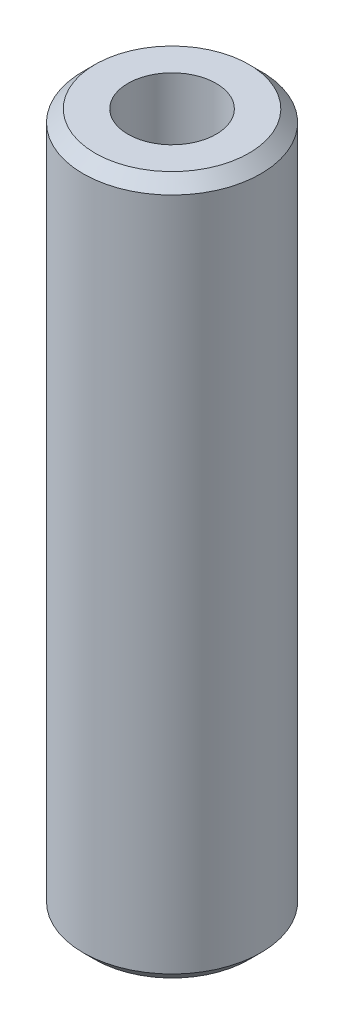
ISO-10303-21;
HEADER;
FILE_DESCRIPTION(('STEP AP214'),'2;1');
FILE_NAME('part.step','',(''),(''),'','','');
FILE_SCHEMA(('AUTOMOTIVE_DESIGN { 1 0 10303 214 1 1 1 1 }'));
ENDSEC;
DATA;
#1=APPLICATION_CONTEXT('core data for automotive mechanical design processes');
#2=APPLICATION_PROTOCOL_DEFINITION('international standard','automotive_design',2000,#1);
#3=PRODUCT_CONTEXT('',#1,'mechanical');
#4=PRODUCT('Part','Part','',(#3));
#5=PRODUCT_RELATED_PRODUCT_CATEGORY('part','',(#4));
#6=PRODUCT_DEFINITION_FORMATION('','',#4);
#7=PRODUCT_DEFINITION_CONTEXT('part definition',#1,'design');
#8=PRODUCT_DEFINITION('design','',#6,#7);
#9=PRODUCT_DEFINITION_SHAPE('','',#8);
#10=(LENGTH_UNIT() NAMED_UNIT(*) SI_UNIT(.MILLI.,.METRE.));
#11=(NAMED_UNIT(*) PLANE_ANGLE_UNIT() SI_UNIT($,.RADIAN.));
#12=(NAMED_UNIT(*) SI_UNIT($,.STERADIAN.) SOLID_ANGLE_UNIT());
#13=UNCERTAINTY_MEASURE_WITH_UNIT(LENGTH_MEASURE(1.E-05),#10,'distance_accuracy_value','');
#14=(GEOMETRIC_REPRESENTATION_CONTEXT(3) GLOBAL_UNCERTAINTY_ASSIGNED_CONTEXT((#13)) GLOBAL_UNIT_ASSIGNED_CONTEXT((#10,
#11,#12)) REPRESENTATION_CONTEXT('',''));
#15=CARTESIAN_POINT('',(0.,0.,0.));
#16=DIRECTION('',(0.,0.,1.));
#17=DIRECTION('',(1.,0.,0.));
#18=AXIS2_PLACEMENT_3D('',#15,#16,#17);
#19=CARTESIAN_POINT('',(0.,78.6237440743389,0.));
#20=DIRECTION('',(0.,-1.,0.));
#21=DIRECTION('',(0.,0.,-1.));
#22=AXIS2_PLACEMENT_3D('',#19,#20,#21);
#23=CYLINDRICAL_SURFACE('',#22,10.);
#24=CARTESIAN_POINT('',(0.,77.2846726138983,0.));
#25=DIRECTION('',(0.,1.,0.));
#26=DIRECTION('',(0.,0.,1.));
#27=AXIS2_PLACEMENT_3D('',#24,#25,#26);
#28=CIRCLE('',#27,10.);
#29=CARTESIAN_POINT('',(0.,77.2846726138983,10.));
#30=VERTEX_POINT('',#29);
#31=EDGE_CURVE('E50',#30,#30,#28,.F.);
#32=ORIENTED_EDGE('',*,*,#31,.T.);
#33=EDGE_LOOP('',(#32));
#34=FACE_BOUND('',#33,.T.);
#35=CARTESIAN_POINT('',(0.,1.3390714604406,0.));
#36=DIRECTION('',(0.,1.,0.));
#37=DIRECTION('',(0.,0.,1.));
#38=AXIS2_PLACEMENT_3D('',#35,#36,#37);
#39=CIRCLE('',#38,10.);
#40=CARTESIAN_POINT('',(0.,1.3390714604406,10.));
#41=VERTEX_POINT('',#40);
#42=EDGE_CURVE('E51',#41,#41,#39,.T.);
#43=ORIENTED_EDGE('',*,*,#42,.T.);
#44=EDGE_LOOP('',(#43));
#45=FACE_BOUND('',#44,.T.);
#46=ADVANCED_FACE('F39',(#34,#45),#23,.T.);
#47=CARTESIAN_POINT('',(0.,78.6237440743389,0.));
#48=DIRECTION('',(0.,1.,0.));
#49=DIRECTION('',(0.,0.,1.));
#50=AXIS2_PLACEMENT_3D('',#47,#48,#49);
#51=PLANE('',#50);
#52=CARTESIAN_POINT('',(0.,78.6237440743389,0.));
#53=DIRECTION('',(0.,1.,0.));
#54=DIRECTION('',(0.,0.,1.));
#55=AXIS2_PLACEMENT_3D('',#52,#53,#54);
#56=CIRCLE('',#55,8.6609285395594);
#57=CARTESIAN_POINT('',(0.,78.6237440743389,8.6609285395594));
#58=VERTEX_POINT('',#57);
#59=EDGE_CURVE('E54',#58,#58,#56,.T.);
#60=ORIENTED_EDGE('',*,*,#59,.T.);
#61=EDGE_LOOP('',(#60));
#62=FACE_BOUND('',#61,.T.);
#63=CARTESIAN_POINT('',(0.,78.6237440743389,0.));
#64=DIRECTION('',(0.,1.,0.));
#65=DIRECTION('',(0.,0.,1.));
#66=AXIS2_PLACEMENT_3D('',#63,#64,#65);
#67=CIRCLE('',#66,4.96523428828797);
#68=CARTESIAN_POINT('',(0.,78.6237440743389,4.96523428828797));
#69=VERTEX_POINT('',#68);
#70=EDGE_CURVE('E58',#69,#69,#67,.T.);
#71=ORIENTED_EDGE('',*,*,#70,.F.);
#72=EDGE_LOOP('',(#71));
#73=FACE_BOUND('',#72,.T.);
#74=ADVANCED_FACE('F69',(#62,#73),#51,.T.);
#75=CARTESIAN_POINT('',(0.,0.,0.));
#76=DIRECTION('',(0.,1.,0.));
#77=DIRECTION('',(0.,0.,1.));
#78=AXIS2_PLACEMENT_3D('',#75,#76,#77);
#79=PLANE('',#78);
#80=CARTESIAN_POINT('',(0.,0.,0.));
#81=DIRECTION('',(0.,1.,0.));
#82=DIRECTION('',(0.,0.,1.));
#83=AXIS2_PLACEMENT_3D('',#80,#81,#82);
#84=CIRCLE('',#83,8.66092853955939);
#85=CARTESIAN_POINT('',(0.,0.,8.66092853955939));
#86=VERTEX_POINT('',#85);
#87=EDGE_CURVE('E10',#86,#86,#84,.F.);
#88=ORIENTED_EDGE('',*,*,#87,.T.);
#89=EDGE_LOOP('',(#88));
#90=FACE_BOUND('',#89,.T.);
#91=CARTESIAN_POINT('',(0.,0.,0.));
#92=DIRECTION('',(0.,1.,0.));
#93=DIRECTION('',(0.,0.,1.));
#94=AXIS2_PLACEMENT_3D('',#91,#92,#93);
#95=CIRCLE('',#94,4.96523428828797);
#96=CARTESIAN_POINT('',(0.,0.,4.96523428828797));
#97=VERTEX_POINT('',#96);
#98=EDGE_CURVE('E63',#97,#97,#95,.T.);
#99=ORIENTED_EDGE('',*,*,#98,.T.);
#100=EDGE_LOOP('',(#99));
#101=FACE_BOUND('',#100,.T.);
#102=ADVANCED_FACE('F75',(#90,#101),#79,.F.);
#103=CARTESIAN_POINT('',(0.,78.6237440743389,0.));
#104=DIRECTION('',(0.,-1.,0.));
#105=DIRECTION('',(0.,0.,-1.));
#106=AXIS2_PLACEMENT_3D('',#103,#104,#105);
#107=CYLINDRICAL_SURFACE('',#106,4.96523428828797);
#108=ORIENTED_EDGE('',*,*,#70,.T.);
#109=EDGE_LOOP('',(#108));
#110=FACE_BOUND('',#109,.T.);
#111=ORIENTED_EDGE('',*,*,#98,.F.);
#112=EDGE_LOOP('',(#111));
#113=FACE_BOUND('',#112,.T.);
#114=ADVANCED_FACE('F70',(#110,#113),#107,.F.);
#115=CARTESIAN_POINT('',(0.,78.6237440743389,0.));
#116=DIRECTION('',(0.,-1.,0.));
#117=DIRECTION('',(0.,0.,-1.));
#118=AXIS2_PLACEMENT_3D('',#115,#116,#117);
#119=CONICAL_SURFACE('',#118,8.6609285395594,0.785398163397443);
#120=ORIENTED_EDGE('',*,*,#31,.F.);
#121=EDGE_LOOP('',(#120));
#122=FACE_BOUND('',#121,.T.);
#123=ORIENTED_EDGE('',*,*,#59,.F.);
#124=EDGE_LOOP('',(#123));
#125=FACE_BOUND('',#124,.T.);
#126=ADVANCED_FACE('F81',(#122,#125),#119,.T.);
#127=CARTESIAN_POINT('',(0.,1.3390714604406,0.));
#128=DIRECTION('',(0.,1.,0.));
#129=DIRECTION('',(0.,0.,1.));
#130=AXIS2_PLACEMENT_3D('',#127,#128,#129);
#131=CONICAL_SURFACE('',#130,10.,0.78539816339745);
#132=ORIENTED_EDGE('',*,*,#87,.F.);
#133=EDGE_LOOP('',(#132));
#134=FACE_BOUND('',#133,.T.);
#135=ORIENTED_EDGE('',*,*,#42,.F.);
#136=EDGE_LOOP('',(#135));
#137=FACE_BOUND('',#136,.T.);
#138=ADVANCED_FACE('F45',(#134,#137),#131,.T.);
#139=CLOSED_SHELL('',(#46,#74,#102,#114,#126,#138));
#140=MANIFOLD_SOLID_BREP('B2',#139);
#141=ADVANCED_BREP_SHAPE_REPRESENTATION('',(#18,#140),#14);
#142=SHAPE_DEFINITION_REPRESENTATION(#9,#141);
ENDSEC;
END-ISO-10303-21;
